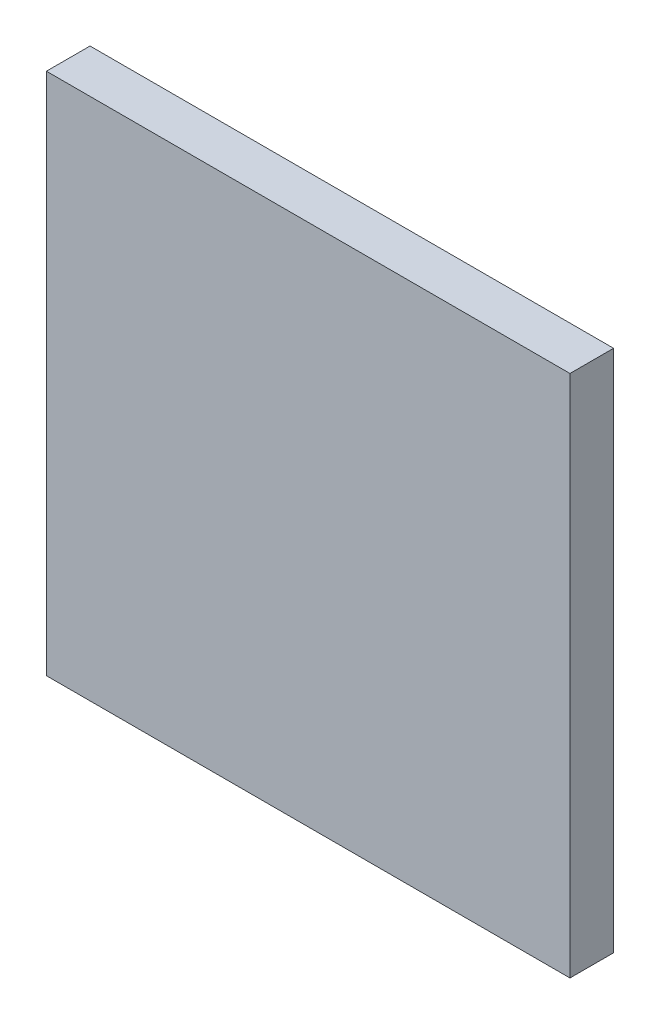
ISO-10303-21;
HEADER;
FILE_DESCRIPTION(('STEP AP214'),'2;1');
FILE_NAME('part.step','',(''),(''),'','','');
FILE_SCHEMA(('AUTOMOTIVE_DESIGN { 1 0 10303 214 1 1 1 1 }'));
ENDSEC;
DATA;
#1=APPLICATION_CONTEXT('core data for automotive mechanical design processes');
#2=APPLICATION_PROTOCOL_DEFINITION('international standard','automotive_design',2000,#1);
#3=PRODUCT_CONTEXT('',#1,'mechanical');
#4=PRODUCT('Part','Part','',(#3));
#5=PRODUCT_RELATED_PRODUCT_CATEGORY('part','',(#4));
#6=PRODUCT_DEFINITION_FORMATION('','',#4);
#7=PRODUCT_DEFINITION_CONTEXT('part definition',#1,'design');
#8=PRODUCT_DEFINITION('design','',#6,#7);
#9=PRODUCT_DEFINITION_SHAPE('','',#8);
#10=(LENGTH_UNIT() NAMED_UNIT(*) SI_UNIT(.MILLI.,.METRE.));
#11=(NAMED_UNIT(*) PLANE_ANGLE_UNIT() SI_UNIT($,.RADIAN.));
#12=(NAMED_UNIT(*) SI_UNIT($,.STERADIAN.) SOLID_ANGLE_UNIT());
#13=UNCERTAINTY_MEASURE_WITH_UNIT(LENGTH_MEASURE(1.E-05),#10,'distance_accuracy_value','');
#14=(GEOMETRIC_REPRESENTATION_CONTEXT(3) GLOBAL_UNCERTAINTY_ASSIGNED_CONTEXT((#13)) GLOBAL_UNIT_ASSIGNED_CONTEXT((#10,
#11,#12)) REPRESENTATION_CONTEXT('',''));
#15=CARTESIAN_POINT('',(0.,0.,0.));
#16=DIRECTION('',(0.,0.,1.));
#17=DIRECTION('',(1.,0.,0.));
#18=AXIS2_PLACEMENT_3D('',#15,#16,#17);
#19=CARTESIAN_POINT('',(0.,0.,2.5));
#20=DIRECTION('',(1.,0.,0.));
#21=DIRECTION('',(0.,0.,-1.));
#22=AXIS2_PLACEMENT_3D('',#19,#20,#21);
#23=PLANE('',#22);
#24=DIRECTION('',(0.,-1.,0.));
#25=VECTOR('',#24,1.);
#26=CARTESIAN_POINT('',(0.,0.,0.));
#27=LINE('',#26,#25);
#28=CARTESIAN_POINT('',(0.,30.,0.));
#29=VERTEX_POINT('',#28);
#30=CARTESIAN_POINT('',(0.,0.,0.));
#31=VERTEX_POINT('',#30);
#32=EDGE_CURVE('E96',#29,#31,#27,.T.);
#33=ORIENTED_EDGE('',*,*,#32,.T.);
#34=DIRECTION('',(0.,0.,-1.));
#35=VECTOR('',#34,1.);
#36=CARTESIAN_POINT('',(0.,0.,2.5));
#37=LINE('',#36,#35);
#38=CARTESIAN_POINT('',(0.,0.,2.5));
#39=VERTEX_POINT('',#38);
#40=EDGE_CURVE('E11',#39,#31,#37,.T.);
#41=ORIENTED_EDGE('',*,*,#40,.F.);
#42=DIRECTION('',(0.,-1.,0.));
#43=VECTOR('',#42,1.);
#44=CARTESIAN_POINT('',(0.,0.,2.5));
#45=LINE('',#44,#43);
#46=CARTESIAN_POINT('',(0.,30.,2.5));
#47=VERTEX_POINT('',#46);
#48=EDGE_CURVE('E84',#47,#39,#45,.T.);
#49=ORIENTED_EDGE('',*,*,#48,.F.);
#50=DIRECTION('',(0.,0.,-1.));
#51=VECTOR('',#50,1.);
#52=CARTESIAN_POINT('',(0.,30.,2.5));
#53=LINE('',#52,#51);
#54=EDGE_CURVE('E92',#47,#29,#53,.T.);
#55=ORIENTED_EDGE('',*,*,#54,.T.);
#56=EDGE_LOOP('',(#33,#41,#49,#55));
#57=FACE_BOUND('',#56,.T.);
#58=ADVANCED_FACE('F33',(#57),#23,.F.);
#59=CARTESIAN_POINT('',(0.,0.,2.5));
#60=DIRECTION('',(0.,1.,0.));
#61=DIRECTION('',(0.,0.,1.));
#62=AXIS2_PLACEMENT_3D('',#59,#60,#61);
#63=PLANE('',#62);
#64=DIRECTION('',(1.,0.,0.));
#65=VECTOR('',#64,1.);
#66=CARTESIAN_POINT('',(0.,0.,0.));
#67=LINE('',#66,#65);
#68=CARTESIAN_POINT('',(30.,0.,0.));
#69=VERTEX_POINT('',#68);
#70=EDGE_CURVE('E88',#31,#69,#67,.T.);
#71=ORIENTED_EDGE('',*,*,#70,.T.);
#72=DIRECTION('',(0.,0.,-1.));
#73=VECTOR('',#72,1.);
#74=CARTESIAN_POINT('',(30.,0.,2.5));
#75=LINE('',#74,#73);
#76=CARTESIAN_POINT('',(30.,0.,2.5));
#77=VERTEX_POINT('',#76);
#78=EDGE_CURVE('E41',#77,#69,#75,.T.);
#79=ORIENTED_EDGE('',*,*,#78,.F.);
#80=DIRECTION('',(1.,0.,0.));
#81=VECTOR('',#80,1.);
#82=CARTESIAN_POINT('',(0.,0.,2.5));
#83=LINE('',#82,#81);
#84=EDGE_CURVE('E79',#39,#77,#83,.T.);
#85=ORIENTED_EDGE('',*,*,#84,.F.);
#86=ORIENTED_EDGE('',*,*,#40,.T.);
#87=EDGE_LOOP('',(#71,#79,#85,#86));
#88=FACE_BOUND('',#87,.T.);
#89=ADVANCED_FACE('F87',(#88),#63,.F.);
#90=CARTESIAN_POINT('',(30.,0.,2.5));
#91=DIRECTION('',(-1.,0.,0.));
#92=DIRECTION('',(0.,-1.,0.));
#93=AXIS2_PLACEMENT_3D('',#90,#91,#92);
#94=PLANE('',#93);
#95=DIRECTION('',(0.,1.,0.));
#96=VECTOR('',#95,1.);
#97=CARTESIAN_POINT('',(30.,0.,0.));
#98=LINE('',#97,#96);
#99=CARTESIAN_POINT('',(30.,30.,0.));
#100=VERTEX_POINT('',#99);
#101=EDGE_CURVE('E66',#69,#100,#98,.T.);
#102=ORIENTED_EDGE('',*,*,#101,.T.);
#103=DIRECTION('',(0.,0.,-1.));
#104=VECTOR('',#103,1.);
#105=CARTESIAN_POINT('',(30.,30.,2.5));
#106=LINE('',#105,#104);
#107=CARTESIAN_POINT('',(30.,30.,2.5));
#108=VERTEX_POINT('',#107);
#109=EDGE_CURVE('E89',#108,#100,#106,.T.);
#110=ORIENTED_EDGE('',*,*,#109,.F.);
#111=DIRECTION('',(0.,1.,0.));
#112=VECTOR('',#111,1.);
#113=CARTESIAN_POINT('',(30.,0.,2.5));
#114=LINE('',#113,#112);
#115=EDGE_CURVE('E82',#77,#108,#114,.T.);
#116=ORIENTED_EDGE('',*,*,#115,.F.);
#117=ORIENTED_EDGE('',*,*,#78,.T.);
#118=EDGE_LOOP('',(#102,#110,#116,#117));
#119=FACE_BOUND('',#118,.T.);
#120=ADVANCED_FACE('F90',(#119),#94,.F.);
#121=CARTESIAN_POINT('',(0.,30.,2.5));
#122=DIRECTION('',(0.,-1.,0.));
#123=DIRECTION('',(0.,0.,-1.));
#124=AXIS2_PLACEMENT_3D('',#121,#122,#123);
#125=PLANE('',#124);
#126=DIRECTION('',(-1.,0.,0.));
#127=VECTOR('',#126,1.);
#128=CARTESIAN_POINT('',(0.,30.,0.));
#129=LINE('',#128,#127);
#130=EDGE_CURVE('E72',#100,#29,#129,.T.);
#131=ORIENTED_EDGE('',*,*,#130,.T.);
#132=ORIENTED_EDGE('',*,*,#54,.F.);
#133=DIRECTION('',(-1.,0.,0.));
#134=VECTOR('',#133,1.);
#135=CARTESIAN_POINT('',(0.,30.,2.5));
#136=LINE('',#135,#134);
#137=EDGE_CURVE('E49',#108,#47,#136,.T.);
#138=ORIENTED_EDGE('',*,*,#137,.F.);
#139=ORIENTED_EDGE('',*,*,#109,.T.);
#140=EDGE_LOOP('',(#131,#132,#138,#139));
#141=FACE_BOUND('',#140,.T.);
#142=ADVANCED_FACE('F103',(#141),#125,.F.);
#143=CARTESIAN_POINT('',(0.,0.,2.5));
#144=DIRECTION('',(0.,0.,-1.));
#145=DIRECTION('',(-1.,0.,0.));
#146=AXIS2_PLACEMENT_3D('',#143,#144,#145);
#147=PLANE('',#146);
#148=ORIENTED_EDGE('',*,*,#48,.T.);
#149=ORIENTED_EDGE('',*,*,#84,.T.);
#150=ORIENTED_EDGE('',*,*,#115,.T.);
#151=ORIENTED_EDGE('',*,*,#137,.T.);
#152=EDGE_LOOP('',(#148,#149,#150,#151));
#153=FACE_BOUND('',#152,.T.);
#154=ADVANCED_FACE('F80',(#153),#147,.F.);
#155=CARTESIAN_POINT('',(0.,0.,0.));
#156=DIRECTION('',(0.,0.,-1.));
#157=DIRECTION('',(-1.,0.,0.));
#158=AXIS2_PLACEMENT_3D('',#155,#156,#157);
#159=PLANE('',#158);
#160=ORIENTED_EDGE('',*,*,#32,.F.);
#161=ORIENTED_EDGE('',*,*,#130,.F.);
#162=ORIENTED_EDGE('',*,*,#101,.F.);
#163=ORIENTED_EDGE('',*,*,#70,.F.);
#164=EDGE_LOOP('',(#160,#161,#162,#163));
#165=FACE_BOUND('',#164,.T.);
#166=ADVANCED_FACE('F106',(#165),#159,.T.);
#167=CLOSED_SHELL('',(#58,#89,#120,#142,#154,#166));
#168=MANIFOLD_SOLID_BREP('B2',#167);
#169=ADVANCED_BREP_SHAPE_REPRESENTATION('',(#18,#168),#14);
#170=SHAPE_DEFINITION_REPRESENTATION(#9,#169);
ENDSEC;
END-ISO-10303-21;
